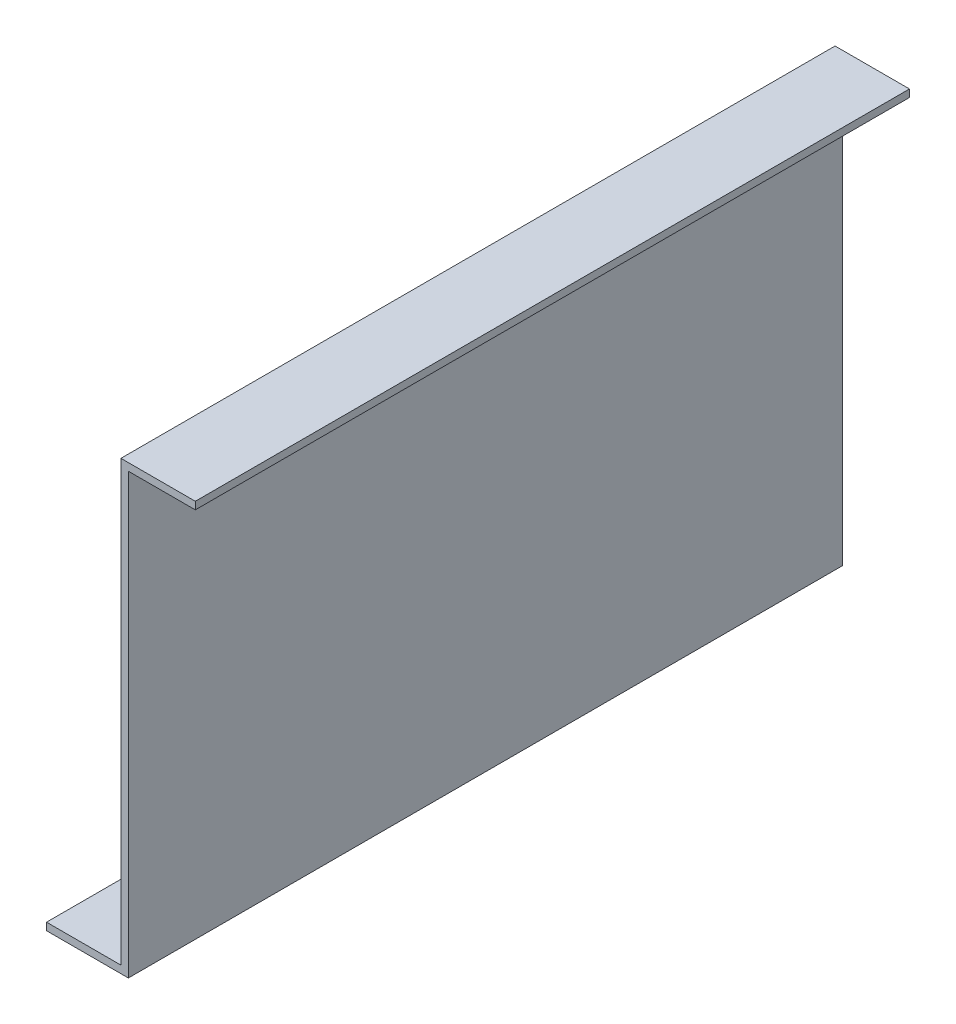
ISO-10303-21;
HEADER;
FILE_DESCRIPTION(('STEP AP214'),'2;1');
FILE_NAME('part.step','',(''),(''),'','','');
FILE_SCHEMA(('AUTOMOTIVE_DESIGN { 1 0 10303 214 1 1 1 1 }'));
ENDSEC;
DATA;
#1=APPLICATION_CONTEXT('core data for automotive mechanical design processes');
#2=APPLICATION_PROTOCOL_DEFINITION('international standard','automotive_design',2000,#1);
#3=PRODUCT_CONTEXT('',#1,'mechanical');
#4=PRODUCT('Part','Part','',(#3));
#5=PRODUCT_RELATED_PRODUCT_CATEGORY('part','',(#4));
#6=PRODUCT_DEFINITION_FORMATION('','',#4);
#7=PRODUCT_DEFINITION_CONTEXT('part definition',#1,'design');
#8=PRODUCT_DEFINITION('design','',#6,#7);
#9=PRODUCT_DEFINITION_SHAPE('','',#8);
#10=(LENGTH_UNIT() NAMED_UNIT(*) SI_UNIT(.MILLI.,.METRE.));
#11=(NAMED_UNIT(*) PLANE_ANGLE_UNIT() SI_UNIT($,.RADIAN.));
#12=(NAMED_UNIT(*) SI_UNIT($,.STERADIAN.) SOLID_ANGLE_UNIT());
#13=UNCERTAINTY_MEASURE_WITH_UNIT(LENGTH_MEASURE(1.E-05),#10,'distance_accuracy_value','');
#14=(GEOMETRIC_REPRESENTATION_CONTEXT(3) GLOBAL_UNCERTAINTY_ASSIGNED_CONTEXT((#13)) GLOBAL_UNIT_ASSIGNED_CONTEXT((#10,
#11,#12)) REPRESENTATION_CONTEXT('',''));
#15=CARTESIAN_POINT('',(0.,0.,0.));
#16=DIRECTION('',(0.,0.,1.));
#17=DIRECTION('',(1.,0.,0.));
#18=AXIS2_PLACEMENT_3D('',#15,#16,#17);
#19=CARTESIAN_POINT('',(20.,116.,192.));
#20=DIRECTION('',(0.,1.,0.));
#21=DIRECTION('',(0.,0.,1.));
#22=AXIS2_PLACEMENT_3D('',#19,#20,#21);
#23=PLANE('',#22);
#24=DIRECTION('',(1.,0.,0.));
#25=VECTOR('',#24,1.);
#26=CARTESIAN_POINT('',(20.,116.,0.));
#27=LINE('',#26,#25);
#28=CARTESIAN_POINT('',(22.,116.,0.));
#29=VERTEX_POINT('',#28);
#30=CARTESIAN_POINT('',(40.,116.,0.));
#31=VERTEX_POINT('',#30);
#32=EDGE_CURVE('E128',#29,#31,#27,.T.);
#33=ORIENTED_EDGE('',*,*,#32,.T.);
#34=DIRECTION('',(0.,0.,-1.));
#35=VECTOR('',#34,1.);
#36=CARTESIAN_POINT('',(40.,116.,192.));
#37=LINE('',#36,#35);
#38=CARTESIAN_POINT('',(40.,116.,192.));
#39=VERTEX_POINT('',#38);
#40=EDGE_CURVE('E11',#39,#31,#37,.T.);
#41=ORIENTED_EDGE('',*,*,#40,.F.);
#42=DIRECTION('',(1.,0.,0.));
#43=VECTOR('',#42,1.);
#44=CARTESIAN_POINT('',(20.,116.,192.));
#45=LINE('',#44,#43);
#46=CARTESIAN_POINT('',(22.,116.,192.));
#47=VERTEX_POINT('',#46);
#48=EDGE_CURVE('E86',#47,#39,#45,.T.);
#49=ORIENTED_EDGE('',*,*,#48,.F.);
#50=DIRECTION('',(0.,0.,-1.));
#51=VECTOR('',#50,1.);
#52=CARTESIAN_POINT('',(22.,116.,192.));
#53=LINE('',#52,#51);
#54=EDGE_CURVE('E127',#47,#29,#53,.T.);
#55=ORIENTED_EDGE('',*,*,#54,.T.);
#56=EDGE_LOOP('',(#33,#41,#49,#55));
#57=FACE_BOUND('',#56,.T.);
#58=ADVANCED_FACE('F31',(#57),#23,.F.);
#59=CARTESIAN_POINT('',(40.,118.,192.));
#60=DIRECTION('',(1.,0.,0.));
#61=DIRECTION('',(0.,0.,-1.));
#62=AXIS2_PLACEMENT_3D('',#59,#60,#61);
#63=PLANE('',#62);
#64=DIRECTION('',(0.,-1.,0.));
#65=VECTOR('',#64,1.);
#66=CARTESIAN_POINT('',(40.,118.,0.));
#67=LINE('',#66,#65);
#68=CARTESIAN_POINT('',(40.,118.,0.));
#69=VERTEX_POINT('',#68);
#70=EDGE_CURVE('E131',#69,#31,#67,.T.);
#71=ORIENTED_EDGE('',*,*,#70,.F.);
#72=DIRECTION('',(0.,0.,-1.));
#73=VECTOR('',#72,1.);
#74=CARTESIAN_POINT('',(40.,118.,192.));
#75=LINE('',#74,#73);
#76=CARTESIAN_POINT('',(40.,118.,192.));
#77=VERTEX_POINT('',#76);
#78=EDGE_CURVE('E39',#77,#69,#75,.T.);
#79=ORIENTED_EDGE('',*,*,#78,.F.);
#80=DIRECTION('',(0.,-1.,0.));
#81=VECTOR('',#80,1.);
#82=CARTESIAN_POINT('',(40.,118.,192.));
#83=LINE('',#82,#81);
#84=EDGE_CURVE('E170',#77,#39,#83,.T.);
#85=ORIENTED_EDGE('',*,*,#84,.T.);
#86=ORIENTED_EDGE('',*,*,#40,.T.);
#87=EDGE_LOOP('',(#71,#79,#85,#86));
#88=FACE_BOUND('',#87,.T.);
#89=ADVANCED_FACE('F161',(#88),#63,.T.);
#90=CARTESIAN_POINT('',(20.,118.,192.));
#91=DIRECTION('',(0.,1.,0.));
#92=DIRECTION('',(0.,0.,1.));
#93=AXIS2_PLACEMENT_3D('',#90,#91,#92);
#94=PLANE('',#93);
#95=DIRECTION('',(1.,0.,0.));
#96=VECTOR('',#95,1.);
#97=CARTESIAN_POINT('',(20.,118.,0.));
#98=LINE('',#97,#96);
#99=CARTESIAN_POINT('',(20.,118.,0.));
#100=VERTEX_POINT('',#99);
#101=EDGE_CURVE('E134',#100,#69,#98,.T.);
#102=ORIENTED_EDGE('',*,*,#101,.F.);
#103=DIRECTION('',(0.,0.,-1.));
#104=VECTOR('',#103,1.);
#105=CARTESIAN_POINT('',(20.,118.,192.));
#106=LINE('',#105,#104);
#107=CARTESIAN_POINT('',(20.,118.,192.));
#108=VERTEX_POINT('',#107);
#109=EDGE_CURVE('E151',#108,#100,#106,.T.);
#110=ORIENTED_EDGE('',*,*,#109,.F.);
#111=DIRECTION('',(1.,0.,0.));
#112=VECTOR('',#111,1.);
#113=CARTESIAN_POINT('',(20.,118.,192.));
#114=LINE('',#113,#112);
#115=EDGE_CURVE('E158',#108,#77,#114,.T.);
#116=ORIENTED_EDGE('',*,*,#115,.T.);
#117=ORIENTED_EDGE('',*,*,#78,.T.);
#118=EDGE_LOOP('',(#102,#110,#116,#117));
#119=FACE_BOUND('',#118,.T.);
#120=ADVANCED_FACE('F156',(#119),#94,.T.);
#121=CARTESIAN_POINT('',(20.,0.,192.));
#122=DIRECTION('',(-1.,0.,0.));
#123=DIRECTION('',(0.,0.,1.));
#124=AXIS2_PLACEMENT_3D('',#121,#122,#123);
#125=PLANE('',#124);
#126=DIRECTION('',(0.,1.,0.));
#127=VECTOR('',#126,1.);
#128=CARTESIAN_POINT('',(20.,0.,0.));
#129=LINE('',#128,#127);
#130=CARTESIAN_POINT('',(20.,0.,0.));
#131=VERTEX_POINT('',#130);
#132=EDGE_CURVE('E137',#131,#100,#129,.T.);
#133=ORIENTED_EDGE('',*,*,#132,.F.);
#134=DIRECTION('',(0.,0.,-1.));
#135=VECTOR('',#134,1.);
#136=CARTESIAN_POINT('',(20.,0.,192.));
#137=LINE('',#136,#135);
#138=CARTESIAN_POINT('',(20.,0.,192.));
#139=VERTEX_POINT('',#138);
#140=EDGE_CURVE('E149',#139,#131,#137,.T.);
#141=ORIENTED_EDGE('',*,*,#140,.F.);
#142=DIRECTION('',(0.,1.,0.));
#143=VECTOR('',#142,1.);
#144=CARTESIAN_POINT('',(20.,0.,192.));
#145=LINE('',#144,#143);
#146=EDGE_CURVE('E122',#139,#108,#145,.T.);
#147=ORIENTED_EDGE('',*,*,#146,.T.);
#148=ORIENTED_EDGE('',*,*,#109,.T.);
#149=EDGE_LOOP('',(#133,#141,#147,#148));
#150=FACE_BOUND('',#149,.T.);
#151=ADVANCED_FACE('F168',(#150),#125,.T.);
#152=CARTESIAN_POINT('',(0.,0.,192.));
#153=DIRECTION('',(0.,1.,0.));
#154=DIRECTION('',(0.,0.,1.));
#155=AXIS2_PLACEMENT_3D('',#152,#153,#154);
#156=PLANE('',#155);
#157=DIRECTION('',(1.,0.,0.));
#158=VECTOR('',#157,1.);
#159=CARTESIAN_POINT('',(0.,0.,0.));
#160=LINE('',#159,#158);
#161=CARTESIAN_POINT('',(0.,0.,0.));
#162=VERTEX_POINT('',#161);
#163=EDGE_CURVE('E140',#162,#131,#160,.T.);
#164=ORIENTED_EDGE('',*,*,#163,.F.);
#165=DIRECTION('',(0.,0.,-1.));
#166=VECTOR('',#165,1.);
#167=CARTESIAN_POINT('',(0.,0.,192.));
#168=LINE('',#167,#166);
#169=CARTESIAN_POINT('',(0.,0.,192.));
#170=VERTEX_POINT('',#169);
#171=EDGE_CURVE('E110',#170,#162,#168,.T.);
#172=ORIENTED_EDGE('',*,*,#171,.F.);
#173=DIRECTION('',(1.,0.,0.));
#174=VECTOR('',#173,1.);
#175=CARTESIAN_POINT('',(0.,0.,192.));
#176=LINE('',#175,#174);
#177=EDGE_CURVE('E120',#170,#139,#176,.T.);
#178=ORIENTED_EDGE('',*,*,#177,.T.);
#179=ORIENTED_EDGE('',*,*,#140,.T.);
#180=EDGE_LOOP('',(#164,#172,#178,#179));
#181=FACE_BOUND('',#180,.T.);
#182=ADVANCED_FACE('F175',(#181),#156,.T.);
#183=CARTESIAN_POINT('',(0.,-2.,192.));
#184=DIRECTION('',(-1.,0.,0.));
#185=DIRECTION('',(0.,0.,1.));
#186=AXIS2_PLACEMENT_3D('',#183,#184,#185);
#187=PLANE('',#186);
#188=DIRECTION('',(0.,1.,0.));
#189=VECTOR('',#188,1.);
#190=CARTESIAN_POINT('',(0.,-2.,0.));
#191=LINE('',#190,#189);
#192=CARTESIAN_POINT('',(0.,-2.,0.));
#193=VERTEX_POINT('',#192);
#194=EDGE_CURVE('E109',#193,#162,#191,.T.);
#195=ORIENTED_EDGE('',*,*,#194,.F.);
#196=DIRECTION('',(0.,0.,-1.));
#197=VECTOR('',#196,1.);
#198=CARTESIAN_POINT('',(0.,-2.,192.));
#199=LINE('',#198,#197);
#200=CARTESIAN_POINT('',(0.,-2.,192.));
#201=VERTEX_POINT('',#200);
#202=EDGE_CURVE('E103',#201,#193,#199,.T.);
#203=ORIENTED_EDGE('',*,*,#202,.F.);
#204=DIRECTION('',(0.,1.,0.));
#205=VECTOR('',#204,1.);
#206=CARTESIAN_POINT('',(0.,-2.,192.));
#207=LINE('',#206,#205);
#208=EDGE_CURVE('E107',#201,#170,#207,.T.);
#209=ORIENTED_EDGE('',*,*,#208,.T.);
#210=ORIENTED_EDGE('',*,*,#171,.T.);
#211=EDGE_LOOP('',(#195,#203,#209,#210));
#212=FACE_BOUND('',#211,.T.);
#213=ADVANCED_FACE('F105',(#212),#187,.T.);
#214=CARTESIAN_POINT('',(0.,-2.,192.));
#215=DIRECTION('',(0.,1.,0.));
#216=DIRECTION('',(0.,0.,1.));
#217=AXIS2_PLACEMENT_3D('',#214,#215,#216);
#218=PLANE('',#217);
#219=DIRECTION('',(1.,0.,0.));
#220=VECTOR('',#219,1.);
#221=CARTESIAN_POINT('',(0.,-2.,0.));
#222=LINE('',#221,#220);
#223=CARTESIAN_POINT('',(22.,-2.,0.));
#224=VERTEX_POINT('',#223);
#225=EDGE_CURVE('E74',#193,#224,#222,.T.);
#226=ORIENTED_EDGE('',*,*,#225,.T.);
#227=DIRECTION('',(0.,0.,-1.));
#228=VECTOR('',#227,1.);
#229=CARTESIAN_POINT('',(22.,-2.,192.));
#230=LINE('',#229,#228);
#231=CARTESIAN_POINT('',(22.,-2.,192.));
#232=VERTEX_POINT('',#231);
#233=EDGE_CURVE('E111',#232,#224,#230,.T.);
#234=ORIENTED_EDGE('',*,*,#233,.F.);
#235=DIRECTION('',(1.,0.,0.));
#236=VECTOR('',#235,1.);
#237=CARTESIAN_POINT('',(0.,-2.,192.));
#238=LINE('',#237,#236);
#239=EDGE_CURVE('E113',#201,#232,#238,.T.);
#240=ORIENTED_EDGE('',*,*,#239,.F.);
#241=ORIENTED_EDGE('',*,*,#202,.T.);
#242=EDGE_LOOP('',(#226,#234,#240,#241));
#243=FACE_BOUND('',#242,.T.);
#244=ADVANCED_FACE('F114',(#243),#218,.F.);
#245=CARTESIAN_POINT('',(22.,0.,192.));
#246=DIRECTION('',(-1.,0.,0.));
#247=DIRECTION('',(0.,0.,1.));
#248=AXIS2_PLACEMENT_3D('',#245,#246,#247);
#249=PLANE('',#248);
#250=DIRECTION('',(0.,1.,0.));
#251=VECTOR('',#250,1.);
#252=CARTESIAN_POINT('',(22.,0.,0.));
#253=LINE('',#252,#251);
#254=EDGE_CURVE('E80',#224,#29,#253,.T.);
#255=ORIENTED_EDGE('',*,*,#254,.T.);
#256=ORIENTED_EDGE('',*,*,#54,.F.);
#257=DIRECTION('',(0.,1.,0.));
#258=VECTOR('',#257,1.);
#259=CARTESIAN_POINT('',(22.,0.,192.));
#260=LINE('',#259,#258);
#261=EDGE_CURVE('E47',#232,#47,#260,.T.);
#262=ORIENTED_EDGE('',*,*,#261,.F.);
#263=ORIENTED_EDGE('',*,*,#233,.T.);
#264=EDGE_LOOP('',(#255,#256,#262,#263));
#265=FACE_BOUND('',#264,.T.);
#266=ADVANCED_FACE('F177',(#265),#249,.F.);
#267=CARTESIAN_POINT('',(40.,116.,192.));
#268=DIRECTION('',(0.,0.,-1.));
#269=DIRECTION('',(-1.,0.,0.));
#270=AXIS2_PLACEMENT_3D('',#267,#268,#269);
#271=PLANE('',#270);
#272=ORIENTED_EDGE('',*,*,#48,.T.);
#273=ORIENTED_EDGE('',*,*,#84,.F.);
#274=ORIENTED_EDGE('',*,*,#115,.F.);
#275=ORIENTED_EDGE('',*,*,#146,.F.);
#276=ORIENTED_EDGE('',*,*,#177,.F.);
#277=ORIENTED_EDGE('',*,*,#208,.F.);
#278=ORIENTED_EDGE('',*,*,#239,.T.);
#279=ORIENTED_EDGE('',*,*,#261,.T.);
#280=EDGE_LOOP('',(#272,#273,#274,#275,#276,#277,#278,#279));
#281=FACE_BOUND('',#280,.T.);
#282=ADVANCED_FACE('F117',(#281),#271,.F.);
#283=CARTESIAN_POINT('',(40.,116.,0.));
#284=DIRECTION('',(0.,0.,-1.));
#285=DIRECTION('',(-1.,0.,0.));
#286=AXIS2_PLACEMENT_3D('',#283,#284,#285);
#287=PLANE('',#286);
#288=ORIENTED_EDGE('',*,*,#32,.F.);
#289=ORIENTED_EDGE('',*,*,#254,.F.);
#290=ORIENTED_EDGE('',*,*,#225,.F.);
#291=ORIENTED_EDGE('',*,*,#194,.T.);
#292=ORIENTED_EDGE('',*,*,#163,.T.);
#293=ORIENTED_EDGE('',*,*,#132,.T.);
#294=ORIENTED_EDGE('',*,*,#101,.T.);
#295=ORIENTED_EDGE('',*,*,#70,.T.);
#296=EDGE_LOOP('',(#288,#289,#290,#291,#292,#293,#294,#295));
#297=FACE_BOUND('',#296,.T.);
#298=ADVANCED_FACE('F164',(#297),#287,.T.);
#299=CLOSED_SHELL('',(#58,#89,#120,#151,#182,#213,#244,#266,#282,#298));
#300=MANIFOLD_SOLID_BREP('B2',#299);
#301=ADVANCED_BREP_SHAPE_REPRESENTATION('',(#18,#300),#14);
#302=SHAPE_DEFINITION_REPRESENTATION(#9,#301);
ENDSEC;
END-ISO-10303-21;
